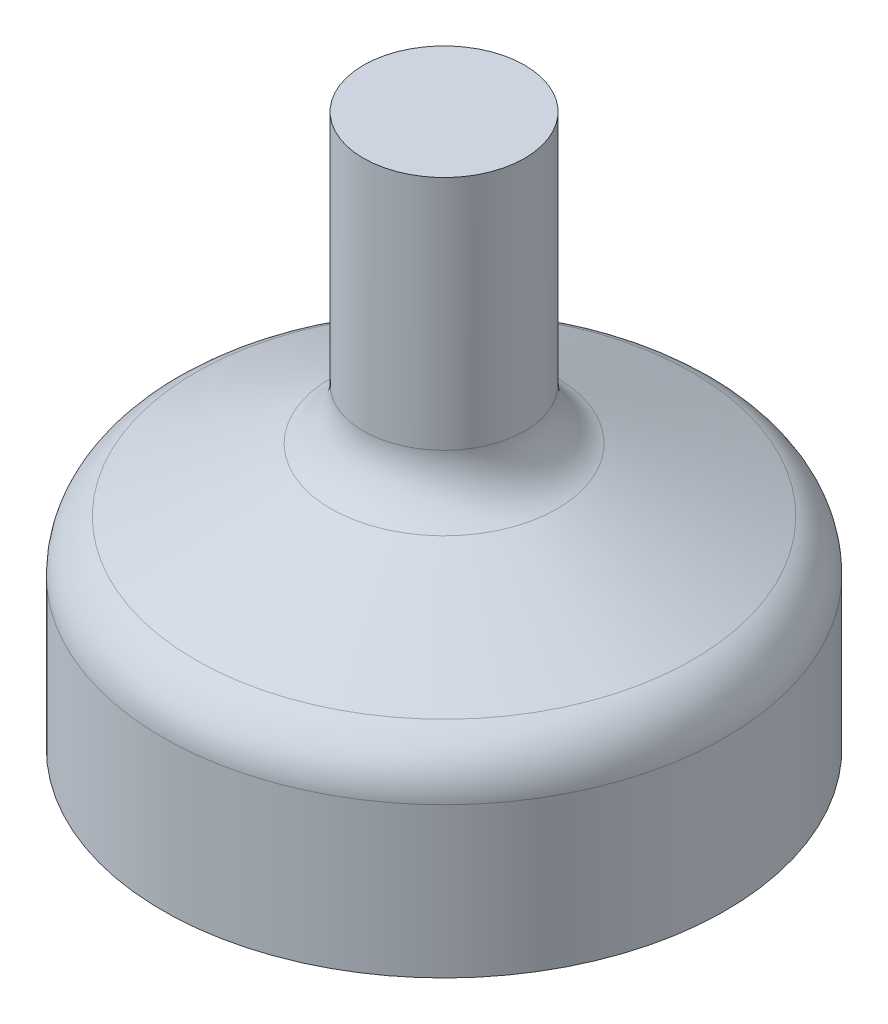
ISO-10303-21;
HEADER;
FILE_DESCRIPTION(('STEP AP214'),'2;1');
FILE_NAME('part.step','',(''),(''),'','','');
FILE_SCHEMA(('AUTOMOTIVE_DESIGN { 1 0 10303 214 1 1 1 1 }'));
ENDSEC;
DATA;
#1=APPLICATION_CONTEXT('core data for automotive mechanical design processes');
#2=APPLICATION_PROTOCOL_DEFINITION('international standard','automotive_design',2000,#1);
#3=PRODUCT_CONTEXT('',#1,'mechanical');
#4=PRODUCT('Part','Part','',(#3));
#5=PRODUCT_RELATED_PRODUCT_CATEGORY('part','',(#4));
#6=PRODUCT_DEFINITION_FORMATION('','',#4);
#7=PRODUCT_DEFINITION_CONTEXT('part definition',#1,'design');
#8=PRODUCT_DEFINITION('design','',#6,#7);
#9=PRODUCT_DEFINITION_SHAPE('','',#8);
#10=(LENGTH_UNIT() NAMED_UNIT(*) SI_UNIT(.MILLI.,.METRE.));
#11=(NAMED_UNIT(*) PLANE_ANGLE_UNIT() SI_UNIT($,.RADIAN.));
#12=(NAMED_UNIT(*) SI_UNIT($,.STERADIAN.) SOLID_ANGLE_UNIT());
#13=UNCERTAINTY_MEASURE_WITH_UNIT(LENGTH_MEASURE(1.E-05),#10,'distance_accuracy_value','');
#14=(GEOMETRIC_REPRESENTATION_CONTEXT(3) GLOBAL_UNCERTAINTY_ASSIGNED_CONTEXT((#13)) GLOBAL_UNIT_ASSIGNED_CONTEXT((#10,
#11,#12)) REPRESENTATION_CONTEXT('',''));
#15=CARTESIAN_POINT('',(0.,0.,0.));
#16=DIRECTION('',(0.,0.,1.));
#17=DIRECTION('',(1.,0.,0.));
#18=AXIS2_PLACEMENT_3D('',#15,#16,#17);
#19=CARTESIAN_POINT('',(0.,-0.227579973653746,0.));
#20=DIRECTION('',(0.,-1.,0.));
#21=DIRECTION('',(0.,0.,-1.));
#22=AXIS2_PLACEMENT_3D('',#19,#20,#21);
#23=CYLINDRICAL_SURFACE('',#22,0.425);
#24=CARTESIAN_POINT('',(0.,6.2,0.));
#25=DIRECTION('',(0.,-1.,0.));
#26=DIRECTION('',(0.,0.,-1.));
#27=AXIS2_PLACEMENT_3D('',#24,#25,#26);
#28=CIRCLE('',#27,0.425);
#29=CARTESIAN_POINT('',(0.,6.2,-0.425));
#30=VERTEX_POINT('',#29);
#31=EDGE_CURVE('E10',#30,#30,#28,.T.);
#32=ORIENTED_EDGE('',*,*,#31,.F.);
#33=EDGE_LOOP('',(#32));
#34=FACE_BOUND('',#33,.T.);
#35=CARTESIAN_POINT('',(0.,4.2,0.));
#36=DIRECTION('',(0.,-1.,0.));
#37=DIRECTION('',(0.,0.,-1.));
#38=AXIS2_PLACEMENT_3D('',#35,#36,#37);
#39=CIRCLE('',#38,0.425);
#40=CARTESIAN_POINT('',(0.,4.2,-0.425));
#41=VERTEX_POINT('',#40);
#42=EDGE_CURVE('E87',#41,#41,#39,.T.);
#43=ORIENTED_EDGE('',*,*,#42,.T.);
#44=EDGE_LOOP('',(#43));
#45=FACE_BOUND('',#44,.T.);
#46=ADVANCED_FACE('F40',(#34,#45),#23,.F.);
#47=CARTESIAN_POINT('',(0.,-0.227579973653746,0.));
#48=DIRECTION('',(0.,-1.,0.));
#49=DIRECTION('',(0.,0.,-1.));
#50=AXIS2_PLACEMENT_3D('',#47,#48,#49);
#51=CYLINDRICAL_SURFACE('',#50,1.075);
#52=CARTESIAN_POINT('',(0.,4.2,0.));
#53=DIRECTION('',(0.,-1.,0.));
#54=DIRECTION('',(0.,0.,-1.));
#55=AXIS2_PLACEMENT_3D('',#52,#53,#54);
#56=CIRCLE('',#55,1.075);
#57=CARTESIAN_POINT('',(0.,4.2,-1.075));
#58=VERTEX_POINT('',#57);
#59=EDGE_CURVE('E47',#58,#58,#56,.T.);
#60=ORIENTED_EDGE('',*,*,#59,.F.);
#61=EDGE_LOOP('',(#60));
#62=FACE_BOUND('',#61,.T.);
#63=CARTESIAN_POINT('',(0.,7.35,0.));
#64=DIRECTION('',(0.,1.,0.));
#65=DIRECTION('',(0.,0.,1.));
#66=AXIS2_PLACEMENT_3D('',#63,#64,#65);
#67=CIRCLE('',#66,1.075);
#68=CARTESIAN_POINT('',(0.,7.35,1.075));
#69=VERTEX_POINT('',#68);
#70=EDGE_CURVE('E91',#69,#69,#67,.T.);
#71=ORIENTED_EDGE('',*,*,#70,.F.);
#72=EDGE_LOOP('',(#71));
#73=FACE_BOUND('',#72,.T.);
#74=ADVANCED_FACE('F98',(#62,#73),#51,.T.);
#75=CARTESIAN_POINT('',(0.,4.2,0.));
#76=DIRECTION('',(0.,-1.,0.));
#77=DIRECTION('',(0.,0.,-1.));
#78=AXIS2_PLACEMENT_3D('',#75,#76,#77);
#79=TOROIDAL_SURFACE('',#78,1.825,0.749999999999999);
#80=ORIENTED_EDGE('',*,*,#59,.T.);
#81=EDGE_LOOP('',(#80));
#82=FACE_BOUND('',#81,.T.);
#83=CARTESIAN_POINT('',(0.,3.51984062776907,0.));
#84=DIRECTION('',(0.,-1.,0.));
#85=DIRECTION('',(0.,0.,-1.));
#86=AXIS2_PLACEMENT_3D('',#83,#84,#85);
#87=CIRCLE('',#86,1.50895692007825);
#88=CARTESIAN_POINT('',(0.,3.51984062776907,-1.50895692007825));
#89=VERTEX_POINT('',#88);
#90=EDGE_CURVE('E52',#89,#89,#87,.T.);
#91=ORIENTED_EDGE('',*,*,#90,.F.);
#92=EDGE_LOOP('',(#91));
#93=FACE_BOUND('',#92,.T.);
#94=ADVANCED_FACE('F100',(#82,#93),#79,.F.);
#95=CARTESIAN_POINT('',(0.,2.68015937223093,0.));
#96=DIRECTION('',(0.,-1.,0.));
#97=DIRECTION('',(0.,0.,-1.));
#98=AXIS2_PLACEMENT_3D('',#95,#96,#97);
#99=CONICAL_SURFACE('',#98,3.31604307992175,1.13581797051234);
#100=ORIENTED_EDGE('',*,*,#90,.T.);
#101=EDGE_LOOP('',(#100));
#102=FACE_BOUND('',#101,.T.);
#103=CARTESIAN_POINT('',(0.,2.68015937223093,0.));
#104=DIRECTION('',(0.,-1.,0.));
#105=DIRECTION('',(0.,0.,-1.));
#106=AXIS2_PLACEMENT_3D('',#103,#104,#105);
#107=CIRCLE('',#106,3.31604307992175);
#108=CARTESIAN_POINT('',(0.,2.68015937223093,-3.31604307992175));
#109=VERTEX_POINT('',#108);
#110=EDGE_CURVE('E57',#109,#109,#107,.T.);
#111=ORIENTED_EDGE('',*,*,#110,.F.);
#112=EDGE_LOOP('',(#111));
#113=FACE_BOUND('',#112,.T.);
#114=ADVANCED_FACE('F106',(#102,#113),#99,.T.);
#115=CARTESIAN_POINT('',(0.,2.,0.));
#116=DIRECTION('',(0.,-1.,0.));
#117=DIRECTION('',(0.,0.,-1.));
#118=AXIS2_PLACEMENT_3D('',#115,#116,#117);
#119=TOROIDAL_SURFACE('',#118,3.,0.749999999999999);
#120=ORIENTED_EDGE('',*,*,#110,.T.);
#121=EDGE_LOOP('',(#120));
#122=FACE_BOUND('',#121,.T.);
#123=CARTESIAN_POINT('',(0.,2.,0.));
#124=DIRECTION('',(0.,-1.,0.));
#125=DIRECTION('',(0.,0.,-1.));
#126=AXIS2_PLACEMENT_3D('',#123,#124,#125);
#127=CIRCLE('',#126,3.75);
#128=CARTESIAN_POINT('',(0.,2.,-3.75));
#129=VERTEX_POINT('',#128);
#130=EDGE_CURVE('E63',#129,#129,#127,.T.);
#131=ORIENTED_EDGE('',*,*,#130,.F.);
#132=EDGE_LOOP('',(#131));
#133=FACE_BOUND('',#132,.T.);
#134=ADVANCED_FACE('F112',(#122,#133),#119,.T.);
#135=CARTESIAN_POINT('',(0.,-0.227579973653746,0.));
#136=DIRECTION('',(0.,-1.,0.));
#137=DIRECTION('',(0.,0.,-1.));
#138=AXIS2_PLACEMENT_3D('',#135,#136,#137);
#139=CYLINDRICAL_SURFACE('',#138,3.75);
#140=ORIENTED_EDGE('',*,*,#130,.T.);
#141=EDGE_LOOP('',(#140));
#142=FACE_BOUND('',#141,.T.);
#143=CARTESIAN_POINT('',(0.,0.,0.));
#144=DIRECTION('',(0.,-1.,0.));
#145=DIRECTION('',(0.,0.,-1.));
#146=AXIS2_PLACEMENT_3D('',#143,#144,#145);
#147=CIRCLE('',#146,3.75);
#148=CARTESIAN_POINT('',(0.,0.,-3.75));
#149=VERTEX_POINT('',#148);
#150=EDGE_CURVE('E67',#149,#149,#147,.T.);
#151=ORIENTED_EDGE('',*,*,#150,.F.);
#152=EDGE_LOOP('',(#151));
#153=FACE_BOUND('',#152,.T.);
#154=ADVANCED_FACE('F116',(#142,#153),#139,.T.);
#155=CARTESIAN_POINT('',(0.,0.,3.1));
#156=DIRECTION('',(0.,-1.,0.));
#157=DIRECTION('',(0.,0.,-1.));
#158=AXIS2_PLACEMENT_3D('',#155,#156,#157);
#159=PLANE('',#158);
#160=ORIENTED_EDGE('',*,*,#150,.T.);
#161=EDGE_LOOP('',(#160));
#162=FACE_BOUND('',#161,.T.);
#163=CARTESIAN_POINT('',(0.,0.,0.));
#164=DIRECTION('',(0.,-1.,0.));
#165=DIRECTION('',(0.,0.,-1.));
#166=AXIS2_PLACEMENT_3D('',#163,#164,#165);
#167=CIRCLE('',#166,3.1);
#168=CARTESIAN_POINT('',(0.,0.,-3.1));
#169=VERTEX_POINT('',#168);
#170=EDGE_CURVE('E71',#169,#169,#167,.T.);
#171=ORIENTED_EDGE('',*,*,#170,.F.);
#172=EDGE_LOOP('',(#171));
#173=FACE_BOUND('',#172,.T.);
#174=ADVANCED_FACE('F120',(#162,#173),#159,.T.);
#175=CARTESIAN_POINT('',(0.,-0.227579973653746,0.));
#176=DIRECTION('',(0.,-1.,0.));
#177=DIRECTION('',(0.,0.,-1.));
#178=AXIS2_PLACEMENT_3D('',#175,#176,#177);
#179=CYLINDRICAL_SURFACE('',#178,3.1);
#180=CARTESIAN_POINT('',(0.,2.,0.));
#181=DIRECTION('',(0.,-1.,0.));
#182=DIRECTION('',(0.,0.,-1.));
#183=AXIS2_PLACEMENT_3D('',#180,#181,#182);
#184=CIRCLE('',#183,3.1);
#185=CARTESIAN_POINT('',(0.,2.,-3.1));
#186=VERTEX_POINT('',#185);
#187=EDGE_CURVE('E75',#186,#186,#184,.T.);
#188=ORIENTED_EDGE('',*,*,#187,.F.);
#189=EDGE_LOOP('',(#188));
#190=FACE_BOUND('',#189,.T.);
#191=ORIENTED_EDGE('',*,*,#170,.T.);
#192=EDGE_LOOP('',(#191));
#193=FACE_BOUND('',#192,.T.);
#194=ADVANCED_FACE('F124',(#190,#193),#179,.F.);
#195=CARTESIAN_POINT('',(0.,2.,0.));
#196=DIRECTION('',(0.,-1.,0.));
#197=DIRECTION('',(0.,0.,-1.));
#198=AXIS2_PLACEMENT_3D('',#195,#196,#197);
#199=TOROIDAL_SURFACE('',#198,3.,0.0999999999999992);
#200=CARTESIAN_POINT('',(0.,2.09068791629746,0.));
#201=DIRECTION('',(0.,-1.,0.));
#202=DIRECTION('',(0.,0.,-1.));
#203=AXIS2_PLACEMENT_3D('',#200,#201,#202);
#204=CIRCLE('',#203,3.0421390773229);
#205=CARTESIAN_POINT('',(0.,2.09068791629746,-3.0421390773229));
#206=VERTEX_POINT('',#205);
#207=EDGE_CURVE('E79',#206,#206,#204,.T.);
#208=ORIENTED_EDGE('',*,*,#207,.F.);
#209=EDGE_LOOP('',(#208));
#210=FACE_BOUND('',#209,.T.);
#211=ORIENTED_EDGE('',*,*,#187,.T.);
#212=EDGE_LOOP('',(#211));
#213=FACE_BOUND('',#212,.T.);
#214=ADVANCED_FACE('F128',(#210,#213),#199,.F.);
#215=CARTESIAN_POINT('',(0.,2.09068791629746,0.));
#216=DIRECTION('',(0.,-1.,0.));
#217=DIRECTION('',(0.,0.,-1.));
#218=AXIS2_PLACEMENT_3D('',#215,#216,#217);
#219=CONICAL_SURFACE('',#218,3.0421390773229,1.13581797051234);
#220=CARTESIAN_POINT('',(0.,2.93036917183559,0.));
#221=DIRECTION('',(0.,-1.,0.));
#222=DIRECTION('',(0.,0.,-1.));
#223=AXIS2_PLACEMENT_3D('',#220,#221,#222);
#224=CIRCLE('',#223,1.23505291747941);
#225=CARTESIAN_POINT('',(0.,2.93036917183559,-1.23505291747941));
#226=VERTEX_POINT('',#225);
#227=EDGE_CURVE('E83',#226,#226,#224,.T.);
#228=ORIENTED_EDGE('',*,*,#227,.F.);
#229=EDGE_LOOP('',(#228));
#230=FACE_BOUND('',#229,.T.);
#231=ORIENTED_EDGE('',*,*,#207,.T.);
#232=EDGE_LOOP('',(#231));
#233=FACE_BOUND('',#232,.T.);
#234=ADVANCED_FACE('F132',(#230,#233),#219,.F.);
#235=CARTESIAN_POINT('',(0.,4.2,0.));
#236=DIRECTION('',(0.,-1.,0.));
#237=DIRECTION('',(0.,0.,-1.));
#238=AXIS2_PLACEMENT_3D('',#235,#236,#237);
#239=TOROIDAL_SURFACE('',#238,1.825,1.4);
#240=ORIENTED_EDGE('',*,*,#42,.F.);
#241=EDGE_LOOP('',(#240));
#242=FACE_BOUND('',#241,.T.);
#243=ORIENTED_EDGE('',*,*,#227,.T.);
#244=EDGE_LOOP('',(#243));
#245=FACE_BOUND('',#244,.T.);
#246=ADVANCED_FACE('F136',(#242,#245),#239,.T.);
#247=CARTESIAN_POINT('',(0.,6.2,0.));
#248=DIRECTION('',(0.,1.,0.));
#249=DIRECTION('',(0.,0.,1.));
#250=AXIS2_PLACEMENT_3D('',#247,#248,#249);
#251=PLANE('',#250);
#252=ORIENTED_EDGE('',*,*,#31,.T.);
#253=EDGE_LOOP('',(#252));
#254=FACE_BOUND('',#253,.T.);
#255=ADVANCED_FACE('F140',(#254),#251,.F.);
#256=CARTESIAN_POINT('',(0.,7.35,0.));
#257=DIRECTION('',(0.,1.,0.));
#258=DIRECTION('',(0.,0.,1.));
#259=AXIS2_PLACEMENT_3D('',#256,#257,#258);
#260=PLANE('',#259);
#261=ORIENTED_EDGE('',*,*,#70,.T.);
#262=EDGE_LOOP('',(#261));
#263=FACE_BOUND('',#262,.T.);
#264=ADVANCED_FACE('F96',(#263),#260,.T.);
#265=CLOSED_SHELL('',(#46,#74,#94,#114,#134,#154,#174,#194,#214,#234,#246,#255,#264));
#266=MANIFOLD_SOLID_BREP('B2',#265);
#267=ADVANCED_BREP_SHAPE_REPRESENTATION('',(#18,#266),#14);
#268=SHAPE_DEFINITION_REPRESENTATION(#9,#267);
ENDSEC;
END-ISO-10303-21;
